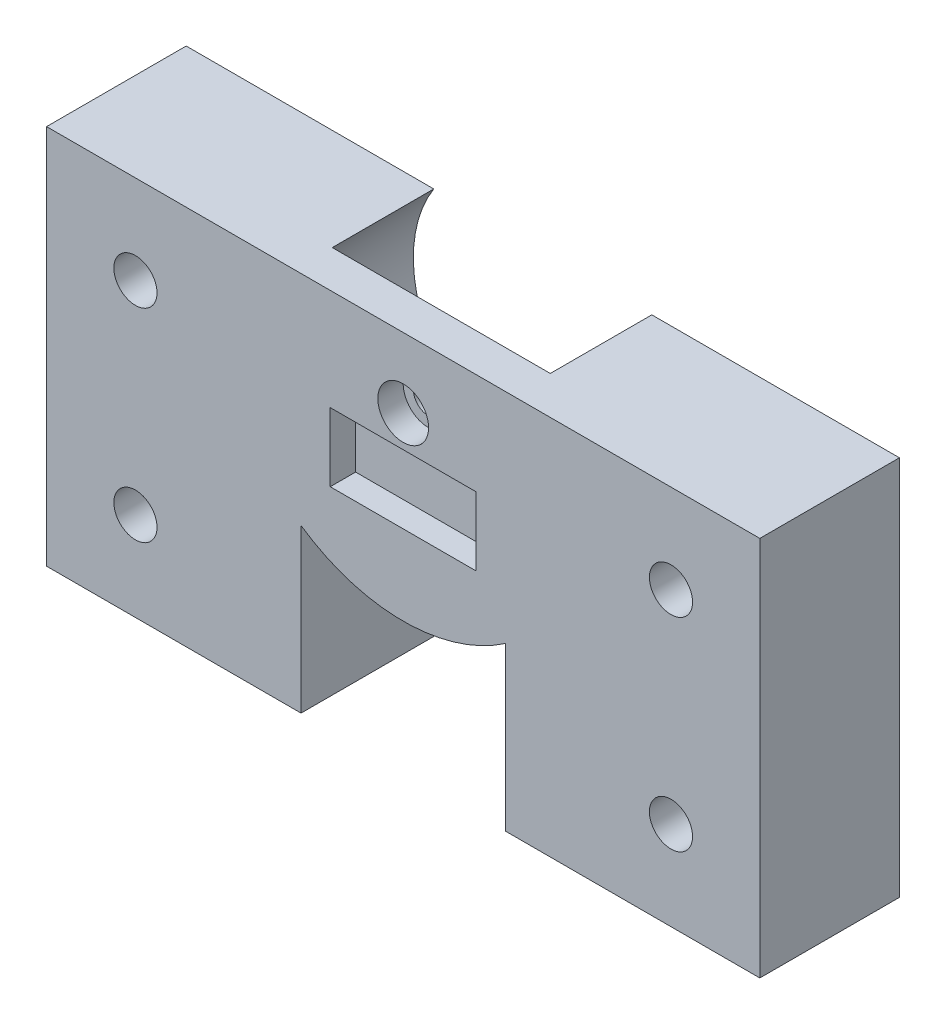
ISO-10303-21;
HEADER;
FILE_DESCRIPTION(('STEP AP214'),'2;1');
FILE_NAME('part.step','',(''),(''),'','','');
FILE_SCHEMA(('AUTOMOTIVE_DESIGN { 1 0 10303 214 1 1 1 1 }'));
ENDSEC;
DATA;
#1=APPLICATION_CONTEXT('core data for automotive mechanical design processes');
#2=APPLICATION_PROTOCOL_DEFINITION('international standard','automotive_design',2000,#1);
#3=PRODUCT_CONTEXT('',#1,'mechanical');
#4=PRODUCT('Part','Part','',(#3));
#5=PRODUCT_RELATED_PRODUCT_CATEGORY('part','',(#4));
#6=PRODUCT_DEFINITION_FORMATION('','',#4);
#7=PRODUCT_DEFINITION_CONTEXT('part definition',#1,'design');
#8=PRODUCT_DEFINITION('design','',#6,#7);
#9=PRODUCT_DEFINITION_SHAPE('','',#8);
#10=(LENGTH_UNIT() NAMED_UNIT(*) SI_UNIT(.MILLI.,.METRE.));
#11=(NAMED_UNIT(*) PLANE_ANGLE_UNIT() SI_UNIT($,.RADIAN.));
#12=(NAMED_UNIT(*) SI_UNIT($,.STERADIAN.) SOLID_ANGLE_UNIT());
#13=UNCERTAINTY_MEASURE_WITH_UNIT(LENGTH_MEASURE(1.E-05),#10,'distance_accuracy_value','');
#14=(GEOMETRIC_REPRESENTATION_CONTEXT(3) GLOBAL_UNCERTAINTY_ASSIGNED_CONTEXT((#13)) GLOBAL_UNIT_ASSIGNED_CONTEXT((#10,
#11,#12)) REPRESENTATION_CONTEXT('',''));
#15=CARTESIAN_POINT('',(0.,0.,0.));
#16=DIRECTION('',(0.,0.,1.));
#17=DIRECTION('',(1.,0.,0.));
#18=AXIS2_PLACEMENT_3D('',#15,#16,#17);
#19=CARTESIAN_POINT('',(-2.08166817117217E-13,-30.,8.));
#20=DIRECTION('',(0.,1.,0.));
#21=DIRECTION('',(-1.,0.,0.));
#22=AXIS2_PLACEMENT_3D('',#19,#20,#21);
#23=PLANE('',#22);
#24=DIRECTION('',(0.,0.,-1.));
#25=VECTOR('',#24,1.);
#26=CARTESIAN_POINT('',(36.15,-30.,11.001));
#27=LINE('',#26,#25);
#28=CARTESIAN_POINT('',(36.15,-30.,11.));
#29=VERTEX_POINT('',#28);
#30=CARTESIAN_POINT('',(36.15,-30.,0.));
#31=VERTEX_POINT('',#30);
#32=EDGE_CURVE('E145',#29,#31,#27,.T.);
#33=ORIENTED_EDGE('',*,*,#32,.T.);
#34=DIRECTION('',(1.,0.,0.));
#35=VECTOR('',#34,1.);
#36=CARTESIAN_POINT('',(-2.08166817117217E-13,-30.,0.));
#37=LINE('',#36,#35);
#38=CARTESIAN_POINT('',(56.2,-30.,0.));
#39=VERTEX_POINT('',#38);
#40=EDGE_CURVE('E187',#31,#39,#37,.T.);
#41=ORIENTED_EDGE('',*,*,#40,.T.);
#42=DIRECTION('',(0.,0.,-1.));
#43=VECTOR('',#42,1.);
#44=CARTESIAN_POINT('',(56.2,-30.,8.));
#45=LINE('',#44,#43);
#46=CARTESIAN_POINT('',(56.2,-29.9999999999996,11.));
#47=VERTEX_POINT('',#46);
#48=EDGE_CURVE('E196',#47,#39,#45,.T.);
#49=ORIENTED_EDGE('',*,*,#48,.F.);
#50=DIRECTION('',(1.,0.,0.));
#51=VECTOR('',#50,1.);
#52=CARTESIAN_POINT('',(-2.08166817117217E-13,-30.,11.));
#53=LINE('',#52,#51);
#54=EDGE_CURVE('E163',#29,#47,#53,.T.);
#55=ORIENTED_EDGE('',*,*,#54,.F.);
#56=EDGE_LOOP('',(#33,#41,#49,#55));
#57=FACE_BOUND('',#56,.T.);
#58=ADVANCED_FACE('F35',(#57),#23,.F.);
#59=DIRECTION('',(0.,0.,-1.));
#60=VECTOR('',#59,1.);
#61=CARTESIAN_POINT('',(20.05,-30.,11.001));
#62=LINE('',#61,#60);
#63=CARTESIAN_POINT('',(20.05,-29.9999999999999,11.));
#64=VERTEX_POINT('',#63);
#65=CARTESIAN_POINT('',(20.05,-30.,0.));
#66=VERTEX_POINT('',#65);
#67=EDGE_CURVE('E140',#64,#66,#62,.T.);
#68=ORIENTED_EDGE('',*,*,#67,.F.);
#69=CARTESIAN_POINT('',(-2.08166817117217E-13,-30.,11.));
#70=VERTEX_POINT('',#69);
#71=EDGE_CURVE('E152',#70,#64,#53,.T.);
#72=ORIENTED_EDGE('',*,*,#71,.F.);
#73=DIRECTION('',(0.,0.,-1.));
#74=VECTOR('',#73,1.);
#75=CARTESIAN_POINT('',(-2.08166817117217E-13,-30.,8.));
#76=LINE('',#75,#74);
#77=CARTESIAN_POINT('',(-2.08166817117217E-13,-30.,0.));
#78=VERTEX_POINT('',#77);
#79=EDGE_CURVE('E199',#70,#78,#76,.T.);
#80=ORIENTED_EDGE('',*,*,#79,.T.);
#81=EDGE_CURVE('E154',#78,#66,#37,.T.);
#82=ORIENTED_EDGE('',*,*,#81,.T.);
#83=EDGE_LOOP('',(#68,#72,#80,#82));
#84=FACE_BOUND('',#83,.T.);
#85=ADVANCED_FACE('F150',(#84),#23,.F.);
#86=CARTESIAN_POINT('',(28.1,-5.50000000000001,0.));
#87=DIRECTION('',(0.,0.,1.));
#88=DIRECTION('',(1.,0.,0.));
#89=AXIS2_PLACEMENT_3D('',#86,#87,#88);
#90=PLANE('',#89);
#91=CARTESIAN_POINT('',(49.1999999999998,-7.,0.));
#92=DIRECTION('',(0.,0.,-1.));
#93=DIRECTION('',(-1.,0.,0.));
#94=AXIS2_PLACEMENT_3D('',#91,#92,#93);
#95=CIRCLE('',#94,1.7);
#96=CARTESIAN_POINT('',(47.4999999999998,-7.,0.));
#97=VERTEX_POINT('',#96);
#98=EDGE_CURVE('E283',#97,#97,#95,.T.);
#99=ORIENTED_EDGE('',*,*,#98,.F.);
#100=EDGE_LOOP('',(#99));
#101=FACE_BOUND('',#100,.T.);
#102=CARTESIAN_POINT('',(49.1999999999998,-23.,0.));
#103=DIRECTION('',(0.,0.,-1.));
#104=DIRECTION('',(1.,0.,0.));
#105=AXIS2_PLACEMENT_3D('',#102,#103,#104);
#106=CIRCLE('',#105,1.69999999999999);
#107=CARTESIAN_POINT('',(50.8999999999998,-23.,0.));
#108=VERTEX_POINT('',#107);
#109=EDGE_CURVE('E262',#108,#108,#106,.T.);
#110=ORIENTED_EDGE('',*,*,#109,.F.);
#111=EDGE_LOOP('',(#110));
#112=FACE_BOUND('',#111,.T.);
#113=CARTESIAN_POINT('',(7.0000000000001,-23.0000000000001,0.));
#114=DIRECTION('',(0.,0.,-1.));
#115=DIRECTION('',(-1.,0.,0.));
#116=AXIS2_PLACEMENT_3D('',#113,#114,#115);
#117=CIRCLE('',#116,1.70000000000001);
#118=CARTESIAN_POINT('',(5.3000000000001,-23.0000000000001,0.));
#119=VERTEX_POINT('',#118);
#120=EDGE_CURVE('E271',#119,#119,#117,.T.);
#121=ORIENTED_EDGE('',*,*,#120,.F.);
#122=EDGE_LOOP('',(#121));
#123=FACE_BOUND('',#122,.T.);
#124=CARTESIAN_POINT('',(7.00000000000008,-6.99999999999992,0.));
#125=DIRECTION('',(0.,0.,-1.));
#126=DIRECTION('',(1.,0.,0.));
#127=AXIS2_PLACEMENT_3D('',#124,#125,#126);
#128=CIRCLE('',#127,1.7);
#129=CARTESIAN_POINT('',(8.70000000000008,-6.99999999999992,0.));
#130=VERTEX_POINT('',#129);
#131=EDGE_CURVE('E263',#130,#130,#128,.T.);
#132=ORIENTED_EDGE('',*,*,#131,.F.);
#133=EDGE_LOOP('',(#132));
#134=FACE_BOUND('',#133,.T.);
#135=DIRECTION('',(0.,1.,0.));
#136=VECTOR('',#135,1.);
#137=CARTESIAN_POINT('',(36.15,-30.,0.));
#138=LINE('',#137,#136);
#139=CARTESIAN_POINT('',(36.15,-17.1977561951,0.));
#140=VERTEX_POINT('',#139);
#141=EDGE_CURVE('E214',#31,#140,#138,.T.);
#142=ORIENTED_EDGE('',*,*,#141,.T.);
#143=CARTESIAN_POINT('',(28.1,-5.50000000000001,0.));
#144=DIRECTION('',(0.,0.,-1.));
#145=DIRECTION('',(1.,0.,0.));
#146=AXIS2_PLACEMENT_3D('',#143,#144,#145);
#147=CIRCLE('',#146,14.2);
#148=CARTESIAN_POINT('',(20.05,-17.1977561951,0.));
#149=VERTEX_POINT('',#148);
#150=EDGE_CURVE('E212',#140,#149,#147,.T.);
#151=ORIENTED_EDGE('',*,*,#150,.T.);
#152=DIRECTION('',(0.,-1.,0.));
#153=VECTOR('',#152,1.);
#154=CARTESIAN_POINT('',(20.05,-30.,0.));
#155=LINE('',#154,#153);
#156=EDGE_CURVE('E155',#149,#66,#155,.T.);
#157=ORIENTED_EDGE('',*,*,#156,.T.);
#158=ORIENTED_EDGE('',*,*,#81,.F.);
#159=DIRECTION('',(0.,-1.,0.));
#160=VECTOR('',#159,1.);
#161=CARTESIAN_POINT('',(0.,0.,0.));
#162=LINE('',#161,#160);
#163=CARTESIAN_POINT('',(0.,0.,0.));
#164=VERTEX_POINT('',#163);
#165=EDGE_CURVE('E185',#164,#78,#162,.T.);
#166=ORIENTED_EDGE('',*,*,#165,.F.);
#167=DIRECTION('',(-1.,0.,0.));
#168=VECTOR('',#167,1.);
#169=CARTESIAN_POINT('',(19.5098894069982,0.,0.));
#170=LINE('',#169,#168);
#171=CARTESIAN_POINT('',(19.5098894069982,0.,0.));
#172=VERTEX_POINT('',#171);
#173=EDGE_CURVE('E183',#172,#164,#170,.T.);
#174=ORIENTED_EDGE('',*,*,#173,.F.);
#175=CARTESIAN_POINT('',(28.1,-5.50000000000001,0.));
#176=DIRECTION('',(0.,0.,-1.));
#177=DIRECTION('',(1.,0.,0.));
#178=AXIS2_PLACEMENT_3D('',#175,#176,#177);
#179=CIRCLE('',#178,10.2);
#180=CARTESIAN_POINT('',(36.6901105930017,0.,0.));
#181=VERTEX_POINT('',#180);
#182=EDGE_CURVE('E166',#181,#172,#179,.T.);
#183=ORIENTED_EDGE('',*,*,#182,.F.);
#184=DIRECTION('',(-1.,0.,0.));
#185=VECTOR('',#184,1.);
#186=CARTESIAN_POINT('',(35.8259303646874,0.,0.));
#187=LINE('',#186,#185);
#188=CARTESIAN_POINT('',(56.1999999999998,0.,0.));
#189=VERTEX_POINT('',#188);
#190=EDGE_CURVE('E180',#189,#181,#187,.T.);
#191=ORIENTED_EDGE('',*,*,#190,.F.);
#192=DIRECTION('',(0.,1.,0.));
#193=VECTOR('',#192,1.);
#194=CARTESIAN_POINT('',(56.1999999999998,0.,0.));
#195=LINE('',#194,#193);
#196=EDGE_CURVE('E189',#39,#189,#195,.T.);
#197=ORIENTED_EDGE('',*,*,#196,.F.);
#198=ORIENTED_EDGE('',*,*,#40,.F.);
#199=EDGE_LOOP('',(#142,#151,#157,#158,#166,#174,#183,#191,#197,#198));
#200=FACE_BOUND('',#199,.T.);
#201=ADVANCED_FACE('F209',(#101,#112,#123,#134,#200),#90,.F.);
#202=CARTESIAN_POINT('',(0.,0.,11.));
#203=DIRECTION('',(0.,0.,1.));
#204=DIRECTION('',(1.,0.,0.));
#205=AXIS2_PLACEMENT_3D('',#202,#203,#204);
#206=PLANE('',#205);
#207=DIRECTION('',(0.,-1.,0.));
#208=VECTOR('',#207,1.);
#209=CARTESIAN_POINT('',(22.35,-8.,11.));
#210=LINE('',#209,#208);
#211=CARTESIAN_POINT('',(22.35,-8.,11.));
#212=VERTEX_POINT('',#211);
#213=CARTESIAN_POINT('',(22.35,-13.4,11.));
#214=VERTEX_POINT('',#213);
#215=EDGE_CURVE('E59',#212,#214,#210,.T.);
#216=ORIENTED_EDGE('',*,*,#215,.F.);
#217=DIRECTION('',(-1.,0.,0.));
#218=VECTOR('',#217,1.);
#219=CARTESIAN_POINT('',(22.35,-8.,11.));
#220=LINE('',#219,#218);
#221=CARTESIAN_POINT('',(33.85,-8.,11.));
#222=VERTEX_POINT('',#221);
#223=EDGE_CURVE('E227',#222,#212,#220,.T.);
#224=ORIENTED_EDGE('',*,*,#223,.F.);
#225=DIRECTION('',(0.,1.,0.));
#226=VECTOR('',#225,1.);
#227=CARTESIAN_POINT('',(33.85,-8.,11.));
#228=LINE('',#227,#226);
#229=CARTESIAN_POINT('',(33.85,-13.4,11.));
#230=VERTEX_POINT('',#229);
#231=EDGE_CURVE('E241',#230,#222,#228,.T.);
#232=ORIENTED_EDGE('',*,*,#231,.F.);
#233=DIRECTION('',(1.,0.,0.));
#234=VECTOR('',#233,1.);
#235=CARTESIAN_POINT('',(22.35,-13.4,11.));
#236=LINE('',#235,#234);
#237=EDGE_CURVE('E238',#214,#230,#236,.T.);
#238=ORIENTED_EDGE('',*,*,#237,.F.);
#239=EDGE_LOOP('',(#216,#224,#232,#238));
#240=FACE_BOUND('',#239,.T.);
#241=CARTESIAN_POINT('',(28.1,-5.50000000000001,11.));
#242=DIRECTION('',(0.,0.,1.));
#243=DIRECTION('',(1.,0.,0.));
#244=AXIS2_PLACEMENT_3D('',#241,#242,#243);
#245=CIRCLE('',#244,2.);
#246=CARTESIAN_POINT('',(30.1,-5.50000000000001,11.));
#247=VERTEX_POINT('',#246);
#248=EDGE_CURVE('E248',#247,#247,#245,.T.);
#249=ORIENTED_EDGE('',*,*,#248,.F.);
#250=EDGE_LOOP('',(#249));
#251=FACE_BOUND('',#250,.T.);
#252=CARTESIAN_POINT('',(7.00000000000008,-6.99999999999992,11.));
#253=DIRECTION('',(0.,0.,1.));
#254=DIRECTION('',(1.,0.,0.));
#255=AXIS2_PLACEMENT_3D('',#252,#253,#254);
#256=CIRCLE('',#255,1.7);
#257=CARTESIAN_POINT('',(8.70000000000008,-6.99999999999992,11.));
#258=VERTEX_POINT('',#257);
#259=EDGE_CURVE('E266',#258,#258,#256,.F.);
#260=ORIENTED_EDGE('',*,*,#259,.T.);
#261=EDGE_LOOP('',(#260));
#262=FACE_BOUND('',#261,.T.);
#263=CARTESIAN_POINT('',(7.0000000000001,-23.0000000000001,11.));
#264=DIRECTION('',(0.,0.,1.));
#265=DIRECTION('',(1.,0.,0.));
#266=AXIS2_PLACEMENT_3D('',#263,#264,#265);
#267=CIRCLE('',#266,1.70000000000001);
#268=CARTESIAN_POINT('',(8.70000000000011,-23.0000000000001,11.));
#269=VERTEX_POINT('',#268);
#270=EDGE_CURVE('E267',#269,#269,#267,.F.);
#271=ORIENTED_EDGE('',*,*,#270,.T.);
#272=EDGE_LOOP('',(#271));
#273=FACE_BOUND('',#272,.T.);
#274=CARTESIAN_POINT('',(49.1999999999998,-23.,11.));
#275=DIRECTION('',(0.,0.,1.));
#276=DIRECTION('',(1.,0.,0.));
#277=AXIS2_PLACEMENT_3D('',#274,#275,#276);
#278=CIRCLE('',#277,1.69999999999999);
#279=CARTESIAN_POINT('',(50.8999999999998,-23.,11.));
#280=VERTEX_POINT('',#279);
#281=EDGE_CURVE('E274',#280,#280,#278,.F.);
#282=ORIENTED_EDGE('',*,*,#281,.T.);
#283=EDGE_LOOP('',(#282));
#284=FACE_BOUND('',#283,.T.);
#285=CARTESIAN_POINT('',(49.1999999999998,-7.,11.));
#286=DIRECTION('',(0.,0.,1.));
#287=DIRECTION('',(1.,0.,0.));
#288=AXIS2_PLACEMENT_3D('',#285,#286,#287);
#289=CIRCLE('',#288,1.7);
#290=CARTESIAN_POINT('',(50.8999999999998,-7.,11.));
#291=VERTEX_POINT('',#290);
#292=EDGE_CURVE('E175',#291,#291,#289,.F.);
#293=ORIENTED_EDGE('',*,*,#292,.T.);
#294=EDGE_LOOP('',(#293));
#295=FACE_BOUND('',#294,.T.);
#296=CARTESIAN_POINT('',(28.1,-5.50000000000001,11.));
#297=DIRECTION('',(0.,0.,1.));
#298=DIRECTION('',(1.,0.,0.));
#299=AXIS2_PLACEMENT_3D('',#296,#297,#298);
#300=CIRCLE('',#299,14.2);
#301=CARTESIAN_POINT('',(36.15,-17.1977561951,11.));
#302=VERTEX_POINT('',#301);
#303=CARTESIAN_POINT('',(20.05,-17.1977561951,11.));
#304=VERTEX_POINT('',#303);
#305=EDGE_CURVE('E51',#302,#304,#300,.F.);
#306=ORIENTED_EDGE('',*,*,#305,.F.);
#307=DIRECTION('',(0.,1.,0.));
#308=VECTOR('',#307,1.);
#309=CARTESIAN_POINT('',(36.15,-30.,11.));
#310=LINE('',#309,#308);
#311=EDGE_CURVE('E568',#29,#302,#310,.T.);
#312=ORIENTED_EDGE('',*,*,#311,.F.);
#313=ORIENTED_EDGE('',*,*,#54,.T.);
#314=DIRECTION('',(0.,1.,0.));
#315=VECTOR('',#314,1.);
#316=CARTESIAN_POINT('',(56.2,-29.9999999999996,11.));
#317=LINE('',#316,#315);
#318=CARTESIAN_POINT('',(56.1999999999998,0.,11.));
#319=VERTEX_POINT('',#318);
#320=EDGE_CURVE('E162',#47,#319,#317,.T.);
#321=ORIENTED_EDGE('',*,*,#320,.T.);
#322=DIRECTION('',(-1.,0.,0.));
#323=VECTOR('',#322,1.);
#324=CARTESIAN_POINT('',(0.,0.,11.));
#325=LINE('',#324,#323);
#326=CARTESIAN_POINT('',(0.,0.,11.));
#327=VERTEX_POINT('',#326);
#328=EDGE_CURVE('E174',#319,#327,#325,.T.);
#329=ORIENTED_EDGE('',*,*,#328,.T.);
#330=DIRECTION('',(0.,-1.,0.));
#331=VECTOR('',#330,1.);
#332=CARTESIAN_POINT('',(0.,0.,11.));
#333=LINE('',#332,#331);
#334=EDGE_CURVE('E161',#327,#70,#333,.T.);
#335=ORIENTED_EDGE('',*,*,#334,.T.);
#336=ORIENTED_EDGE('',*,*,#71,.T.);
#337=DIRECTION('',(0.,-1.,0.));
#338=VECTOR('',#337,1.);
#339=CARTESIAN_POINT('',(20.05,-30.,11.));
#340=LINE('',#339,#338);
#341=EDGE_CURVE('E136',#304,#64,#340,.T.);
#342=ORIENTED_EDGE('',*,*,#341,.F.);
#343=EDGE_LOOP('',(#306,#312,#313,#321,#329,#335,#336,#342));
#344=FACE_BOUND('',#343,.T.);
#345=ADVANCED_FACE('F158',(#240,#251,#262,#273,#284,#295,#344),#206,.T.);
#346=CARTESIAN_POINT('',(28.1,-5.50000000000001,15.8083261120685));
#347=DIRECTION('',(0.,0.,-1.));
#348=DIRECTION('',(-1.,0.,0.));
#349=AXIS2_PLACEMENT_3D('',#346,#347,#348);
#350=CYLINDRICAL_SURFACE('',#349,1.2);
#351=CARTESIAN_POINT('',(28.1,-5.50000000000001,8.));
#352=DIRECTION('',(0.,0.,1.));
#353=DIRECTION('',(1.,0.,0.));
#354=AXIS2_PLACEMENT_3D('',#351,#352,#353);
#355=CIRCLE('',#354,1.2);
#356=CARTESIAN_POINT('',(29.3,-5.50000000000001,8.));
#357=VERTEX_POINT('',#356);
#358=EDGE_CURVE('E270',#357,#357,#355,.T.);
#359=ORIENTED_EDGE('',*,*,#358,.F.);
#360=EDGE_LOOP('',(#359));
#361=FACE_BOUND('',#360,.T.);
#362=CARTESIAN_POINT('',(28.1,-5.50000000000001,9.));
#363=DIRECTION('',(0.,0.,1.));
#364=DIRECTION('',(1.,0.,0.));
#365=AXIS2_PLACEMENT_3D('',#362,#363,#364);
#366=CIRCLE('',#365,1.2);
#367=CARTESIAN_POINT('',(29.3,-5.50000000000001,9.));
#368=VERTEX_POINT('',#367);
#369=EDGE_CURVE('E39',#368,#368,#366,.F.);
#370=ORIENTED_EDGE('',*,*,#369,.F.);
#371=EDGE_LOOP('',(#370));
#372=FACE_BOUND('',#371,.T.);
#373=ADVANCED_FACE('F325',(#361,#372),#350,.F.);
#374=CARTESIAN_POINT('',(28.1,-5.50000000000001,8.));
#375=DIRECTION('',(0.,0.,-1.));
#376=DIRECTION('',(-1.,0.,0.));
#377=AXIS2_PLACEMENT_3D('',#374,#375,#376);
#378=CYLINDRICAL_SURFACE('',#377,10.2);
#379=ORIENTED_EDGE('',*,*,#182,.T.);
#380=DIRECTION('',(0.,0.,-1.));
#381=VECTOR('',#380,1.);
#382=CARTESIAN_POINT('',(19.5098894069982,0.,8.));
#383=LINE('',#382,#381);
#384=CARTESIAN_POINT('',(19.5098894069982,0.,8.));
#385=VERTEX_POINT('',#384);
#386=EDGE_CURVE('E11',#385,#172,#383,.T.);
#387=ORIENTED_EDGE('',*,*,#386,.F.);
#388=CARTESIAN_POINT('',(28.1,-5.50000000000001,8.));
#389=DIRECTION('',(0.,0.,-1.));
#390=DIRECTION('',(1.,0.,0.));
#391=AXIS2_PLACEMENT_3D('',#388,#389,#390);
#392=CIRCLE('',#391,10.2);
#393=CARTESIAN_POINT('',(36.6901105930017,0.,8.));
#394=VERTEX_POINT('',#393);
#395=EDGE_CURVE('E176',#394,#385,#392,.T.);
#396=ORIENTED_EDGE('',*,*,#395,.F.);
#397=DIRECTION('',(0.,0.,-1.));
#398=VECTOR('',#397,1.);
#399=CARTESIAN_POINT('',(36.6901105930017,0.,33.741989045138));
#400=LINE('',#399,#398);
#401=EDGE_CURVE('E259',#394,#181,#400,.T.);
#402=ORIENTED_EDGE('',*,*,#401,.T.);
#403=EDGE_LOOP('',(#379,#387,#396,#402));
#404=FACE_BOUND('',#403,.T.);
#405=ADVANCED_FACE('F37',(#404),#378,.F.);
#406=CARTESIAN_POINT('',(0.,0.,8.));
#407=DIRECTION('',(1.,0.,0.));
#408=DIRECTION('',(0.,1.,0.));
#409=AXIS2_PLACEMENT_3D('',#406,#407,#408);
#410=PLANE('',#409);
#411=ORIENTED_EDGE('',*,*,#165,.T.);
#412=ORIENTED_EDGE('',*,*,#79,.F.);
#413=ORIENTED_EDGE('',*,*,#334,.F.);
#414=DIRECTION('',(0.,0.,-1.));
#415=VECTOR('',#414,1.);
#416=CARTESIAN_POINT('',(0.,0.,8.));
#417=LINE('',#416,#415);
#418=EDGE_CURVE('E44',#327,#164,#417,.T.);
#419=ORIENTED_EDGE('',*,*,#418,.T.);
#420=EDGE_LOOP('',(#411,#412,#413,#419));
#421=FACE_BOUND('',#420,.T.);
#422=ADVANCED_FACE('F204',(#421),#410,.F.);
#423=CARTESIAN_POINT('',(56.1999999999998,0.,8.));
#424=DIRECTION('',(-1.,0.,0.));
#425=DIRECTION('',(0.,-1.,0.));
#426=AXIS2_PLACEMENT_3D('',#423,#424,#425);
#427=PLANE('',#426);
#428=ORIENTED_EDGE('',*,*,#196,.T.);
#429=DIRECTION('',(0.,0.,-1.));
#430=VECTOR('',#429,1.);
#431=CARTESIAN_POINT('',(56.1999999999998,0.,8.));
#432=LINE('',#431,#430);
#433=EDGE_CURVE('E179',#319,#189,#432,.T.);
#434=ORIENTED_EDGE('',*,*,#433,.F.);
#435=ORIENTED_EDGE('',*,*,#320,.F.);
#436=ORIENTED_EDGE('',*,*,#48,.T.);
#437=EDGE_LOOP('',(#428,#434,#435,#436));
#438=FACE_BOUND('',#437,.T.);
#439=ADVANCED_FACE('F291',(#438),#427,.F.);
#440=CARTESIAN_POINT('',(35.8259303646874,0.,8.));
#441=DIRECTION('',(0.,-1.,0.));
#442=DIRECTION('',(0.,0.,-1.));
#443=AXIS2_PLACEMENT_3D('',#440,#441,#442);
#444=PLANE('',#443);
#445=ORIENTED_EDGE('',*,*,#401,.F.);
#446=DIRECTION('',(-1.,0.,0.));
#447=VECTOR('',#446,1.);
#448=CARTESIAN_POINT('',(0.,0.,8.));
#449=LINE('',#448,#447);
#450=EDGE_CURVE('E171',#394,#385,#449,.T.);
#451=ORIENTED_EDGE('',*,*,#450,.T.);
#452=ORIENTED_EDGE('',*,*,#386,.T.);
#453=ORIENTED_EDGE('',*,*,#173,.T.);
#454=ORIENTED_EDGE('',*,*,#418,.F.);
#455=ORIENTED_EDGE('',*,*,#328,.F.);
#456=ORIENTED_EDGE('',*,*,#433,.T.);
#457=ORIENTED_EDGE('',*,*,#190,.T.);
#458=EDGE_LOOP('',(#445,#451,#452,#453,#454,#455,#456,#457));
#459=FACE_BOUND('',#458,.T.);
#460=ADVANCED_FACE('F289',(#459),#444,.F.);
#461=CARTESIAN_POINT('',(0.,0.,8.));
#462=DIRECTION('',(0.,0.,1.));
#463=DIRECTION('',(1.,0.,0.));
#464=AXIS2_PLACEMENT_3D('',#461,#462,#463);
#465=PLANE('',#464);
#466=ORIENTED_EDGE('',*,*,#358,.T.);
#467=EDGE_LOOP('',(#466));
#468=FACE_BOUND('',#467,.T.);
#469=ORIENTED_EDGE('',*,*,#450,.F.);
#470=ORIENTED_EDGE('',*,*,#395,.T.);
#471=EDGE_LOOP('',(#469,#470));
#472=FACE_BOUND('',#471,.T.);
#473=ADVANCED_FACE('F298',(#468,#472),#465,.F.);
#474=CARTESIAN_POINT('',(49.1999999999998,-7.,15.8083261120685));
#475=DIRECTION('',(0.,0.,-1.));
#476=DIRECTION('',(-1.,0.,0.));
#477=AXIS2_PLACEMENT_3D('',#474,#475,#476);
#478=CYLINDRICAL_SURFACE('',#477,1.7);
#479=ORIENTED_EDGE('',*,*,#98,.T.);
#480=EDGE_LOOP('',(#479));
#481=FACE_BOUND('',#480,.T.);
#482=ORIENTED_EDGE('',*,*,#292,.F.);
#483=EDGE_LOOP('',(#482));
#484=FACE_BOUND('',#483,.T.);
#485=ADVANCED_FACE('F300',(#481,#484),#478,.F.);
#486=CARTESIAN_POINT('',(49.1999999999998,-23.,15.8083261120685));
#487=DIRECTION('',(0.,0.,-1.));
#488=DIRECTION('',(-1.,0.,0.));
#489=AXIS2_PLACEMENT_3D('',#486,#487,#488);
#490=CYLINDRICAL_SURFACE('',#489,1.69999999999999);
#491=ORIENTED_EDGE('',*,*,#109,.T.);
#492=EDGE_LOOP('',(#491));
#493=FACE_BOUND('',#492,.T.);
#494=ORIENTED_EDGE('',*,*,#281,.F.);
#495=EDGE_LOOP('',(#494));
#496=FACE_BOUND('',#495,.T.);
#497=ADVANCED_FACE('F307',(#493,#496),#490,.F.);
#498=CARTESIAN_POINT('',(7.0000000000001,-23.0000000000001,15.8083261120685));
#499=DIRECTION('',(0.,0.,-1.));
#500=DIRECTION('',(-1.,0.,0.));
#501=AXIS2_PLACEMENT_3D('',#498,#499,#500);
#502=CYLINDRICAL_SURFACE('',#501,1.70000000000001);
#503=ORIENTED_EDGE('',*,*,#120,.T.);
#504=EDGE_LOOP('',(#503));
#505=FACE_BOUND('',#504,.T.);
#506=ORIENTED_EDGE('',*,*,#270,.F.);
#507=EDGE_LOOP('',(#506));
#508=FACE_BOUND('',#507,.T.);
#509=ADVANCED_FACE('F340',(#505,#508),#502,.F.);
#510=CARTESIAN_POINT('',(7.00000000000008,-6.99999999999992,15.8083261120685));
#511=DIRECTION('',(0.,0.,-1.));
#512=DIRECTION('',(-1.,0.,0.));
#513=AXIS2_PLACEMENT_3D('',#510,#511,#512);
#514=CYLINDRICAL_SURFACE('',#513,1.7);
#515=ORIENTED_EDGE('',*,*,#131,.T.);
#516=EDGE_LOOP('',(#515));
#517=FACE_BOUND('',#516,.T.);
#518=ORIENTED_EDGE('',*,*,#259,.F.);
#519=EDGE_LOOP('',(#518));
#520=FACE_BOUND('',#519,.T.);
#521=ADVANCED_FACE('F344',(#517,#520),#514,.F.);
#522=CARTESIAN_POINT('',(28.1,-5.50000000000001,9.));
#523=DIRECTION('',(0.,0.,1.));
#524=DIRECTION('',(1.,0.,0.));
#525=AXIS2_PLACEMENT_3D('',#522,#523,#524);
#526=PLANE('',#525);
#527=CARTESIAN_POINT('',(28.1,-5.50000000000001,9.));
#528=DIRECTION('',(0.,0.,1.));
#529=DIRECTION('',(1.,0.,0.));
#530=AXIS2_PLACEMENT_3D('',#527,#528,#529);
#531=CIRCLE('',#530,2.);
#532=CARTESIAN_POINT('',(30.1,-5.50000000000001,9.));
#533=VERTEX_POINT('',#532);
#534=EDGE_CURVE('E254',#533,#533,#531,.T.);
#535=ORIENTED_EDGE('',*,*,#534,.T.);
#536=EDGE_LOOP('',(#535));
#537=FACE_BOUND('',#536,.T.);
#538=ORIENTED_EDGE('',*,*,#369,.T.);
#539=EDGE_LOOP('',(#538));
#540=FACE_BOUND('',#539,.T.);
#541=ADVANCED_FACE('F348',(#537,#540),#526,.T.);
#542=CARTESIAN_POINT('',(28.1,-5.50000000000001,9.));
#543=DIRECTION('',(0.,0.,1.));
#544=DIRECTION('',(1.,0.,0.));
#545=AXIS2_PLACEMENT_3D('',#542,#543,#544);
#546=CYLINDRICAL_SURFACE('',#545,2.);
#547=ORIENTED_EDGE('',*,*,#534,.F.);
#548=EDGE_LOOP('',(#547));
#549=FACE_BOUND('',#548,.T.);
#550=ORIENTED_EDGE('',*,*,#248,.T.);
#551=EDGE_LOOP('',(#550));
#552=FACE_BOUND('',#551,.T.);
#553=ADVANCED_FACE('F350',(#549,#552),#546,.F.);
#554=CARTESIAN_POINT('',(22.35,-8.,9.));
#555=DIRECTION('',(-1.,0.,0.));
#556=DIRECTION('',(0.,0.,1.));
#557=AXIS2_PLACEMENT_3D('',#554,#555,#556);
#558=PLANE('',#557);
#559=ORIENTED_EDGE('',*,*,#215,.T.);
#560=DIRECTION('',(0.,0.,1.));
#561=VECTOR('',#560,1.);
#562=CARTESIAN_POINT('',(22.35,-13.4,9.));
#563=LINE('',#562,#561);
#564=CARTESIAN_POINT('',(22.35,-13.4,9.));
#565=VERTEX_POINT('',#564);
#566=EDGE_CURVE('E236',#565,#214,#563,.T.);
#567=ORIENTED_EDGE('',*,*,#566,.F.);
#568=DIRECTION('',(0.,-1.,0.));
#569=VECTOR('',#568,1.);
#570=CARTESIAN_POINT('',(22.35,-8.,9.));
#571=LINE('',#570,#569);
#572=CARTESIAN_POINT('',(22.35,-8.,9.));
#573=VERTEX_POINT('',#572);
#574=EDGE_CURVE('E223',#573,#565,#571,.T.);
#575=ORIENTED_EDGE('',*,*,#574,.F.);
#576=DIRECTION('',(0.,0.,1.));
#577=VECTOR('',#576,1.);
#578=CARTESIAN_POINT('',(22.35,-8.,9.));
#579=LINE('',#578,#577);
#580=EDGE_CURVE('E246',#573,#212,#579,.T.);
#581=ORIENTED_EDGE('',*,*,#580,.T.);
#582=EDGE_LOOP('',(#559,#567,#575,#581));
#583=FACE_BOUND('',#582,.T.);
#584=ADVANCED_FACE('F353',(#583),#558,.F.);
#585=CARTESIAN_POINT('',(22.35,-8.,9.));
#586=DIRECTION('',(0.,1.,0.));
#587=DIRECTION('',(0.,0.,1.));
#588=AXIS2_PLACEMENT_3D('',#585,#586,#587);
#589=PLANE('',#588);
#590=ORIENTED_EDGE('',*,*,#223,.T.);
#591=ORIENTED_EDGE('',*,*,#580,.F.);
#592=DIRECTION('',(-1.,0.,0.));
#593=VECTOR('',#592,1.);
#594=CARTESIAN_POINT('',(22.35,-8.,9.));
#595=LINE('',#594,#593);
#596=CARTESIAN_POINT('',(33.85,-8.,9.));
#597=VERTEX_POINT('',#596);
#598=EDGE_CURVE('E233',#597,#573,#595,.T.);
#599=ORIENTED_EDGE('',*,*,#598,.F.);
#600=DIRECTION('',(0.,0.,1.));
#601=VECTOR('',#600,1.);
#602=CARTESIAN_POINT('',(33.85,-8.,9.));
#603=LINE('',#602,#601);
#604=EDGE_CURVE('E249',#597,#222,#603,.T.);
#605=ORIENTED_EDGE('',*,*,#604,.T.);
#606=EDGE_LOOP('',(#590,#591,#599,#605));
#607=FACE_BOUND('',#606,.T.);
#608=ADVANCED_FACE('F360',(#607),#589,.F.);
#609=CARTESIAN_POINT('',(33.85,-8.,9.));
#610=DIRECTION('',(1.,0.,0.));
#611=DIRECTION('',(0.,0.,-1.));
#612=AXIS2_PLACEMENT_3D('',#609,#610,#611);
#613=PLANE('',#612);
#614=ORIENTED_EDGE('',*,*,#231,.T.);
#615=ORIENTED_EDGE('',*,*,#604,.F.);
#616=DIRECTION('',(0.,1.,0.));
#617=VECTOR('',#616,1.);
#618=CARTESIAN_POINT('',(33.85,-8.,9.));
#619=LINE('',#618,#617);
#620=CARTESIAN_POINT('',(33.85,-13.4,9.));
#621=VERTEX_POINT('',#620);
#622=EDGE_CURVE('E230',#621,#597,#619,.T.);
#623=ORIENTED_EDGE('',*,*,#622,.F.);
#624=DIRECTION('',(0.,0.,1.));
#625=VECTOR('',#624,1.);
#626=CARTESIAN_POINT('',(33.85,-13.4,9.));
#627=LINE('',#626,#625);
#628=EDGE_CURVE('E251',#621,#230,#627,.T.);
#629=ORIENTED_EDGE('',*,*,#628,.T.);
#630=EDGE_LOOP('',(#614,#615,#623,#629));
#631=FACE_BOUND('',#630,.T.);
#632=ADVANCED_FACE('F365',(#631),#613,.F.);
#633=CARTESIAN_POINT('',(22.35,-13.4,9.));
#634=DIRECTION('',(0.,-1.,0.));
#635=DIRECTION('',(1.,0.,0.));
#636=AXIS2_PLACEMENT_3D('',#633,#634,#635);
#637=PLANE('',#636);
#638=ORIENTED_EDGE('',*,*,#237,.T.);
#639=ORIENTED_EDGE('',*,*,#628,.F.);
#640=DIRECTION('',(1.,0.,0.));
#641=VECTOR('',#640,1.);
#642=CARTESIAN_POINT('',(22.35,-13.4,9.));
#643=LINE('',#642,#641);
#644=EDGE_CURVE('E226',#565,#621,#643,.T.);
#645=ORIENTED_EDGE('',*,*,#644,.F.);
#646=ORIENTED_EDGE('',*,*,#566,.T.);
#647=EDGE_LOOP('',(#638,#639,#645,#646));
#648=FACE_BOUND('',#647,.T.);
#649=ADVANCED_FACE('F361',(#648),#637,.F.);
#650=CARTESIAN_POINT('',(0.,0.,9.));
#651=DIRECTION('',(0.,0.,1.));
#652=DIRECTION('',(1.,0.,0.));
#653=AXIS2_PLACEMENT_3D('',#650,#651,#652);
#654=PLANE('',#653);
#655=ORIENTED_EDGE('',*,*,#574,.T.);
#656=ORIENTED_EDGE('',*,*,#644,.T.);
#657=ORIENTED_EDGE('',*,*,#622,.T.);
#658=ORIENTED_EDGE('',*,*,#598,.T.);
#659=EDGE_LOOP('',(#655,#656,#657,#658));
#660=FACE_BOUND('',#659,.T.);
#661=ADVANCED_FACE('F364',(#660),#654,.T.);
#662=CARTESIAN_POINT('',(36.15,-30.,11.001));
#663=DIRECTION('',(-1.,0.,0.));
#664=DIRECTION('',(0.,0.,1.));
#665=AXIS2_PLACEMENT_3D('',#662,#663,#664);
#666=PLANE('',#665);
#667=ORIENTED_EDGE('',*,*,#311,.T.);
#668=DIRECTION('',(0.,0.,-1.));
#669=VECTOR('',#668,1.);
#670=CARTESIAN_POINT('',(36.15,-17.1977561951,11.001));
#671=LINE('',#670,#669);
#672=EDGE_CURVE('E219',#302,#140,#671,.T.);
#673=ORIENTED_EDGE('',*,*,#672,.T.);
#674=ORIENTED_EDGE('',*,*,#141,.F.);
#675=ORIENTED_EDGE('',*,*,#32,.F.);
#676=EDGE_LOOP('',(#667,#673,#674,#675));
#677=FACE_BOUND('',#676,.T.);
#678=ADVANCED_FACE('F375',(#677),#666,.T.);
#679=CARTESIAN_POINT('',(28.1,-5.50000000000001,11.001));
#680=DIRECTION('',(0.,0.,-1.));
#681=DIRECTION('',(-1.,0.,0.));
#682=AXIS2_PLACEMENT_3D('',#679,#680,#681);
#683=CYLINDRICAL_SURFACE('',#682,14.2);
#684=ORIENTED_EDGE('',*,*,#305,.T.);
#685=DIRECTION('',(0.,0.,-1.));
#686=VECTOR('',#685,1.);
#687=CARTESIAN_POINT('',(20.05,-17.1977561951,11.001));
#688=LINE('',#687,#686);
#689=EDGE_CURVE('E142',#304,#149,#688,.T.);
#690=ORIENTED_EDGE('',*,*,#689,.T.);
#691=ORIENTED_EDGE('',*,*,#150,.F.);
#692=ORIENTED_EDGE('',*,*,#672,.F.);
#693=EDGE_LOOP('',(#684,#690,#691,#692));
#694=FACE_BOUND('',#693,.T.);
#695=ADVANCED_FACE('F379',(#694),#683,.T.);
#696=CARTESIAN_POINT('',(20.05,-30.,11.001));
#697=DIRECTION('',(1.,0.,0.));
#698=DIRECTION('',(0.,1.,0.));
#699=AXIS2_PLACEMENT_3D('',#696,#697,#698);
#700=PLANE('',#699);
#701=ORIENTED_EDGE('',*,*,#341,.T.);
#702=ORIENTED_EDGE('',*,*,#67,.T.);
#703=ORIENTED_EDGE('',*,*,#156,.F.);
#704=ORIENTED_EDGE('',*,*,#689,.F.);
#705=EDGE_LOOP('',(#701,#702,#703,#704));
#706=FACE_BOUND('',#705,.T.);
#707=ADVANCED_FACE('F138',(#706),#700,.T.);
#708=CLOSED_SHELL('',(#58,#85,#201,#345,#373,#405,#422,#439,#460,#473,#485,#497,#509,#521,#541,
#553,#584,#608,#632,#649,#661,#678,#695,#707));
#709=MANIFOLD_SOLID_BREP('B2',#708);
#710=ADVANCED_BREP_SHAPE_REPRESENTATION('',(#18,#709),#14);
#711=SHAPE_DEFINITION_REPRESENTATION(#9,#710);
ENDSEC;
END-ISO-10303-21;
